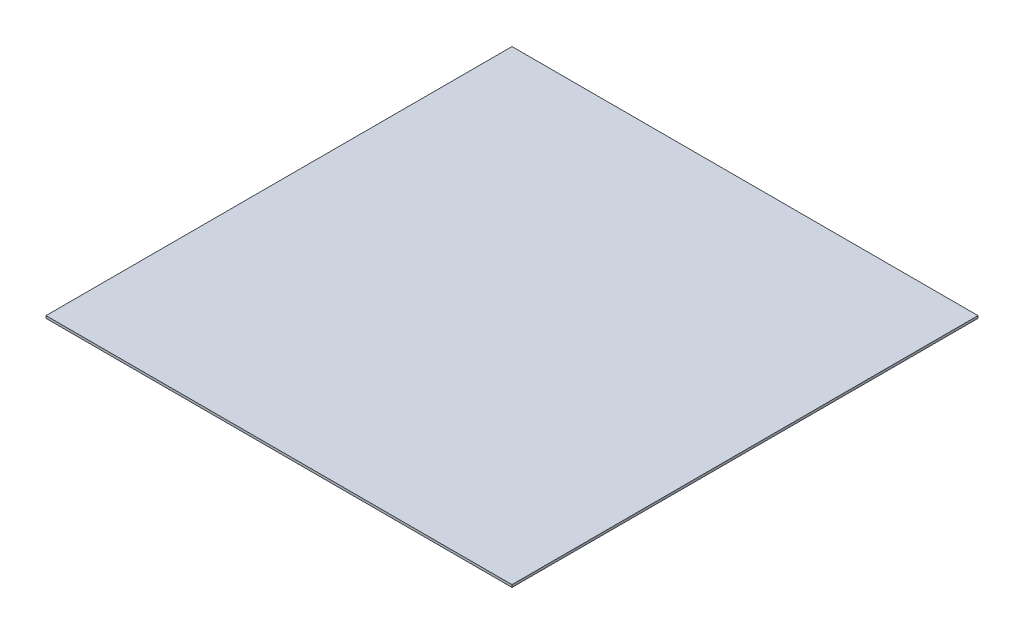
ISO-10303-21;
HEADER;
FILE_DESCRIPTION(('STEP AP214'),'2;1');
FILE_NAME('part.step','',(''),(''),'','','');
FILE_SCHEMA(('AUTOMOTIVE_DESIGN { 1 0 10303 214 1 1 1 1 }'));
ENDSEC;
DATA;
#1=APPLICATION_CONTEXT('core data for automotive mechanical design processes');
#2=APPLICATION_PROTOCOL_DEFINITION('international standard','automotive_design',2000,#1);
#3=PRODUCT_CONTEXT('',#1,'mechanical');
#4=PRODUCT('Part','Part','',(#3));
#5=PRODUCT_RELATED_PRODUCT_CATEGORY('part','',(#4));
#6=PRODUCT_DEFINITION_FORMATION('','',#4);
#7=PRODUCT_DEFINITION_CONTEXT('part definition',#1,'design');
#8=PRODUCT_DEFINITION('design','',#6,#7);
#9=PRODUCT_DEFINITION_SHAPE('','',#8);
#10=(LENGTH_UNIT() NAMED_UNIT(*) SI_UNIT(.MILLI.,.METRE.));
#11=(NAMED_UNIT(*) PLANE_ANGLE_UNIT() SI_UNIT($,.RADIAN.));
#12=(NAMED_UNIT(*) SI_UNIT($,.STERADIAN.) SOLID_ANGLE_UNIT());
#13=UNCERTAINTY_MEASURE_WITH_UNIT(LENGTH_MEASURE(1.E-05),#10,'distance_accuracy_value','');
#14=(GEOMETRIC_REPRESENTATION_CONTEXT(3) GLOBAL_UNCERTAINTY_ASSIGNED_CONTEXT((#13)) GLOBAL_UNIT_ASSIGNED_CONTEXT((#10,
#11,#12)) REPRESENTATION_CONTEXT('',''));
#15=CARTESIAN_POINT('',(0.,0.,0.));
#16=DIRECTION('',(0.,0.,1.));
#17=DIRECTION('',(1.,0.,0.));
#18=AXIS2_PLACEMENT_3D('',#15,#16,#17);
#19=CARTESIAN_POINT('',(303.276000000002,3.175,303.275999999999));
#20=DIRECTION('',(-1.,0.,0.));
#21=DIRECTION('',(0.,0.,1.));
#22=AXIS2_PLACEMENT_3D('',#19,#20,#21);
#23=PLANE('',#22);
#24=DIRECTION('',(0.,0.,-1.));
#25=VECTOR('',#24,1.);
#26=CARTESIAN_POINT('',(303.276000000002,0.,303.275999999999));
#27=LINE('',#26,#25);
#28=CARTESIAN_POINT('',(303.276000000002,0.,303.275999999999));
#29=VERTEX_POINT('',#28);
#30=CARTESIAN_POINT('',(303.276000000002,0.,-303.276000000002));
#31=VERTEX_POINT('',#30);
#32=EDGE_CURVE('E96',#29,#31,#27,.T.);
#33=ORIENTED_EDGE('',*,*,#32,.T.);
#34=DIRECTION('',(0.,-1.,0.));
#35=VECTOR('',#34,1.);
#36=CARTESIAN_POINT('',(303.276000000002,3.175,-303.276000000002));
#37=LINE('',#36,#35);
#38=CARTESIAN_POINT('',(303.276000000002,3.175,-303.276000000002));
#39=VERTEX_POINT('',#38);
#40=EDGE_CURVE('E11',#39,#31,#37,.T.);
#41=ORIENTED_EDGE('',*,*,#40,.F.);
#42=DIRECTION('',(0.,0.,-1.));
#43=VECTOR('',#42,1.);
#44=CARTESIAN_POINT('',(303.276000000002,3.175,303.275999999999));
#45=LINE('',#44,#43);
#46=CARTESIAN_POINT('',(303.276000000002,3.175,303.275999999999));
#47=VERTEX_POINT('',#46);
#48=EDGE_CURVE('E84',#47,#39,#45,.T.);
#49=ORIENTED_EDGE('',*,*,#48,.F.);
#50=DIRECTION('',(0.,-1.,0.));
#51=VECTOR('',#50,1.);
#52=CARTESIAN_POINT('',(303.276000000002,3.175,303.275999999999));
#53=LINE('',#52,#51);
#54=EDGE_CURVE('E92',#47,#29,#53,.T.);
#55=ORIENTED_EDGE('',*,*,#54,.T.);
#56=EDGE_LOOP('',(#33,#41,#49,#55));
#57=FACE_BOUND('',#56,.T.);
#58=ADVANCED_FACE('F33',(#57),#23,.F.);
#59=CARTESIAN_POINT('',(-303.275999999999,3.175,-303.276000000002));
#60=DIRECTION('',(0.,0.,1.));
#61=DIRECTION('',(1.,0.,0.));
#62=AXIS2_PLACEMENT_3D('',#59,#60,#61);
#63=PLANE('',#62);
#64=DIRECTION('',(-1.,0.,0.));
#65=VECTOR('',#64,1.);
#66=CARTESIAN_POINT('',(-303.275999999999,0.,-303.276000000002));
#67=LINE('',#66,#65);
#68=CARTESIAN_POINT('',(-303.275999999999,0.,-303.276000000002));
#69=VERTEX_POINT('',#68);
#70=EDGE_CURVE('E88',#31,#69,#67,.T.);
#71=ORIENTED_EDGE('',*,*,#70,.T.);
#72=DIRECTION('',(0.,-1.,0.));
#73=VECTOR('',#72,1.);
#74=CARTESIAN_POINT('',(-303.275999999999,3.175,-303.276000000002));
#75=LINE('',#74,#73);
#76=CARTESIAN_POINT('',(-303.275999999999,3.175,-303.276000000002));
#77=VERTEX_POINT('',#76);
#78=EDGE_CURVE('E41',#77,#69,#75,.T.);
#79=ORIENTED_EDGE('',*,*,#78,.F.);
#80=DIRECTION('',(-1.,0.,0.));
#81=VECTOR('',#80,1.);
#82=CARTESIAN_POINT('',(-303.275999999999,3.175,-303.276000000002));
#83=LINE('',#82,#81);
#84=EDGE_CURVE('E79',#39,#77,#83,.T.);
#85=ORIENTED_EDGE('',*,*,#84,.F.);
#86=ORIENTED_EDGE('',*,*,#40,.T.);
#87=EDGE_LOOP('',(#71,#79,#85,#86));
#88=FACE_BOUND('',#87,.T.);
#89=ADVANCED_FACE('F87',(#88),#63,.F.);
#90=CARTESIAN_POINT('',(-303.275999999999,3.175,303.275999999999));
#91=DIRECTION('',(1.,0.,0.));
#92=DIRECTION('',(0.,0.,-1.));
#93=AXIS2_PLACEMENT_3D('',#90,#91,#92);
#94=PLANE('',#93);
#95=DIRECTION('',(0.,0.,1.));
#96=VECTOR('',#95,1.);
#97=CARTESIAN_POINT('',(-303.275999999999,0.,303.275999999999));
#98=LINE('',#97,#96);
#99=CARTESIAN_POINT('',(-303.275999999999,0.,303.275999999999));
#100=VERTEX_POINT('',#99);
#101=EDGE_CURVE('E66',#69,#100,#98,.T.);
#102=ORIENTED_EDGE('',*,*,#101,.T.);
#103=DIRECTION('',(0.,-1.,0.));
#104=VECTOR('',#103,1.);
#105=CARTESIAN_POINT('',(-303.275999999999,3.175,303.275999999999));
#106=LINE('',#105,#104);
#107=CARTESIAN_POINT('',(-303.275999999999,3.175,303.275999999999));
#108=VERTEX_POINT('',#107);
#109=EDGE_CURVE('E89',#108,#100,#106,.T.);
#110=ORIENTED_EDGE('',*,*,#109,.F.);
#111=DIRECTION('',(0.,0.,1.));
#112=VECTOR('',#111,1.);
#113=CARTESIAN_POINT('',(-303.275999999999,3.175,303.275999999999));
#114=LINE('',#113,#112);
#115=EDGE_CURVE('E82',#77,#108,#114,.T.);
#116=ORIENTED_EDGE('',*,*,#115,.F.);
#117=ORIENTED_EDGE('',*,*,#78,.T.);
#118=EDGE_LOOP('',(#102,#110,#116,#117));
#119=FACE_BOUND('',#118,.T.);
#120=ADVANCED_FACE('F90',(#119),#94,.F.);
#121=CARTESIAN_POINT('',(-303.275999999999,3.175,303.275999999999));
#122=DIRECTION('',(0.,0.,-1.));
#123=DIRECTION('',(-1.,0.,0.));
#124=AXIS2_PLACEMENT_3D('',#121,#122,#123);
#125=PLANE('',#124);
#126=DIRECTION('',(1.,0.,0.));
#127=VECTOR('',#126,1.);
#128=CARTESIAN_POINT('',(-303.275999999999,0.,303.275999999999));
#129=LINE('',#128,#127);
#130=EDGE_CURVE('E72',#100,#29,#129,.T.);
#131=ORIENTED_EDGE('',*,*,#130,.T.);
#132=ORIENTED_EDGE('',*,*,#54,.F.);
#133=DIRECTION('',(1.,0.,0.));
#134=VECTOR('',#133,1.);
#135=CARTESIAN_POINT('',(-303.275999999999,3.175,303.275999999999));
#136=LINE('',#135,#134);
#137=EDGE_CURVE('E49',#108,#47,#136,.T.);
#138=ORIENTED_EDGE('',*,*,#137,.F.);
#139=ORIENTED_EDGE('',*,*,#109,.T.);
#140=EDGE_LOOP('',(#131,#132,#138,#139));
#141=FACE_BOUND('',#140,.T.);
#142=ADVANCED_FACE('F103',(#141),#125,.F.);
#143=CARTESIAN_POINT('',(0.,3.175,0.));
#144=DIRECTION('',(0.,-1.,0.));
#145=DIRECTION('',(0.,0.,-1.));
#146=AXIS2_PLACEMENT_3D('',#143,#144,#145);
#147=PLANE('',#146);
#148=ORIENTED_EDGE('',*,*,#48,.T.);
#149=ORIENTED_EDGE('',*,*,#84,.T.);
#150=ORIENTED_EDGE('',*,*,#115,.T.);
#151=ORIENTED_EDGE('',*,*,#137,.T.);
#152=EDGE_LOOP('',(#148,#149,#150,#151));
#153=FACE_BOUND('',#152,.T.);
#154=ADVANCED_FACE('F80',(#153),#147,.F.);
#155=CARTESIAN_POINT('',(0.,0.,0.));
#156=DIRECTION('',(0.,-1.,0.));
#157=DIRECTION('',(0.,0.,-1.));
#158=AXIS2_PLACEMENT_3D('',#155,#156,#157);
#159=PLANE('',#158);
#160=ORIENTED_EDGE('',*,*,#32,.F.);
#161=ORIENTED_EDGE('',*,*,#130,.F.);
#162=ORIENTED_EDGE('',*,*,#101,.F.);
#163=ORIENTED_EDGE('',*,*,#70,.F.);
#164=EDGE_LOOP('',(#160,#161,#162,#163));
#165=FACE_BOUND('',#164,.T.);
#166=ADVANCED_FACE('F106',(#165),#159,.T.);
#167=CLOSED_SHELL('',(#58,#89,#120,#142,#154,#166));
#168=MANIFOLD_SOLID_BREP('B2',#167);
#169=ADVANCED_BREP_SHAPE_REPRESENTATION('',(#18,#168),#14);
#170=SHAPE_DEFINITION_REPRESENTATION(#9,#169);
ENDSEC;
END-ISO-10303-21;
